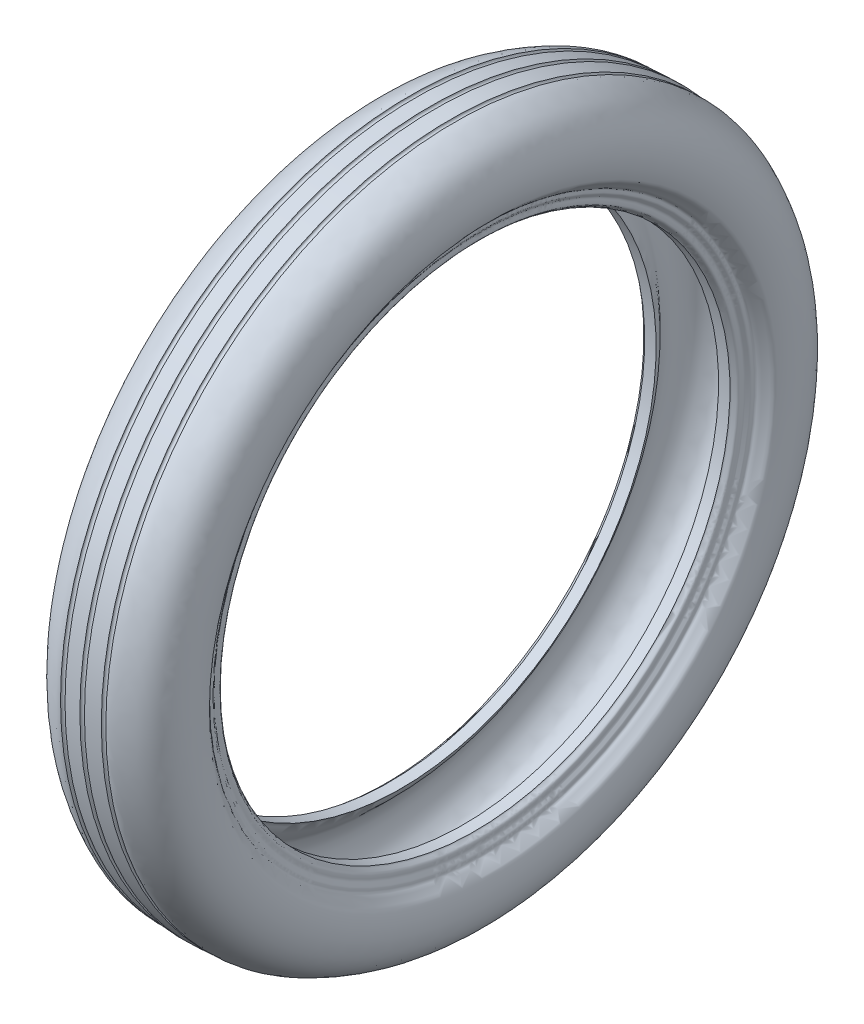
ISO-10303-21;
HEADER;
FILE_DESCRIPTION(('STEP AP214'),'2;1');
FILE_NAME('part.step','',(''),(''),'','','');
FILE_SCHEMA(('AUTOMOTIVE_DESIGN { 1 0 10303 214 1 1 1 1 }'));
ENDSEC;
DATA;
#1=APPLICATION_CONTEXT('core data for automotive mechanical design processes');
#2=APPLICATION_PROTOCOL_DEFINITION('international standard','automotive_design',2000,#1);
#3=PRODUCT_CONTEXT('',#1,'mechanical');
#4=PRODUCT('Part','Part','',(#3));
#5=PRODUCT_RELATED_PRODUCT_CATEGORY('part','',(#4));
#6=PRODUCT_DEFINITION_FORMATION('','',#4);
#7=PRODUCT_DEFINITION_CONTEXT('part definition',#1,'design');
#8=PRODUCT_DEFINITION('design','',#6,#7);
#9=PRODUCT_DEFINITION_SHAPE('','',#8);
#10=(LENGTH_UNIT() NAMED_UNIT(*) SI_UNIT(.MILLI.,.METRE.));
#11=(NAMED_UNIT(*) PLANE_ANGLE_UNIT() SI_UNIT($,.RADIAN.));
#12=(NAMED_UNIT(*) SI_UNIT($,.STERADIAN.) SOLID_ANGLE_UNIT());
#13=UNCERTAINTY_MEASURE_WITH_UNIT(LENGTH_MEASURE(1.E-05),#10,'distance_accuracy_value','');
#14=(GEOMETRIC_REPRESENTATION_CONTEXT(3) GLOBAL_UNCERTAINTY_ASSIGNED_CONTEXT((#13)) GLOBAL_UNIT_ASSIGNED_CONTEXT((#10,
#11,#12)) REPRESENTATION_CONTEXT('',''));
#15=CARTESIAN_POINT('',(0.,0.,0.));
#16=DIRECTION('',(0.,0.,1.));
#17=DIRECTION('',(1.,0.,0.));
#18=AXIS2_PLACEMENT_3D('',#15,#16,#17);
#19=CARTESIAN_POINT('',(-24.8172630139917,203.,0.));
#20=CARTESIAN_POINT('',(-27.2283998288289,205.06391431928,0.));
#21=CARTESIAN_POINT('',(-28.5496427344952,210.327625908058,0.));
#22=CARTESIAN_POINT('',(-33.6712545353592,215.019378984169,0.));
#23=CARTESIAN_POINT('',(-37.7772976660351,219.010363555149,0.));
#24=CARTESIAN_POINT('',(-42.2633577257313,223.062020269606,0.));
#25=CARTESIAN_POINT('',(-45.1671204187017,229.55393791157,0.));
#26=CARTESIAN_POINT('',(-48.0286654197166,236.65779205585,0.));
#27=CARTESIAN_POINT('',(-47.8879674715827,244.882513096217,0.));
#28=CARTESIAN_POINT('',(-46.3948773163548,254.057111445877,0.));
#29=CARTESIAN_POINT('',(-40.3486929351291,261.403587543646,0.));
#30=CARTESIAN_POINT('',(-33.851481321555,268.81086706887,0.));
#31=CARTESIAN_POINT('',(-25.2444175261157,271.404992130535,0.));
#32=CARTESIAN_POINT('',(-16.7423312191855,273.18641912113,0.));
#33=CARTESIAN_POINT('',(-10.1405547550226,273.463220362378,0.));
#34=CARTESIAN_POINT('',(-4.54429512443643,274.014061695448,0.));
#35=CARTESIAN_POINT('',(-1.75340207589833,273.445280920895,0.));
#36=CARTESIAN_POINT('',(0.,273.651830628835,0.));
#37=B_SPLINE_CURVE_WITH_KNOTS('',3,(#19,#20,#21,#22,#23,#24,#25,#26,#27,#28,#29,#30,#31,#32,#33,
#34,#35,#36),.UNSPECIFIED.,.F.,.F.,(4,1,1,1,1,1,1,1,1,1,1,1,1,1,1,4),(0.,0.0822330624444425,
0.137617146698626,0.183009302880853,0.237253629031035,0.297469874379483,0.371716047539101,
0.44060468979368,0.515818013596818,0.616103802574389,0.690267434104086,0.776013817716258,
0.849380324821276,0.924772592656254,0.952990480004338,1.),.UNSPECIFIED.);
#38=CARTESIAN_POINT('',(-102.722911074857,0.,0.));
#39=DIRECTION('',(-1.,0.,0.));
#40=AXIS1_PLACEMENT('',#38,#39);
#41=SURFACE_OF_REVOLUTION('',#37,#40);
#42=CARTESIAN_POINT('',(0.,0.,0.));
#43=DIRECTION('',(-1.,0.,0.));
#44=DIRECTION('',(0.,0.,1.));
#45=AXIS2_PLACEMENT_3D('',#42,#43,#44);
#46=CIRCLE('',#45,273.651830628835);
#47=CARTESIAN_POINT('',(0.,0.,273.651830628835));
#48=VERTEX_POINT('',#47);
#49=EDGE_CURVE('E10',#48,#48,#46,.T.);
#50=ORIENTED_EDGE('',*,*,#49,.F.);
#51=EDGE_LOOP('',(#50));
#52=FACE_BOUND('',#51,.T.);
#53=CARTESIAN_POINT('',(-24.8172630139917,0.,0.));
#54=DIRECTION('',(-1.,0.,0.));
#55=DIRECTION('',(0.,0.,1.));
#56=AXIS2_PLACEMENT_3D('',#53,#54,#55);
#57=CIRCLE('',#56,203.);
#58=CARTESIAN_POINT('',(-24.8172630139917,0.,203.));
#59=VERTEX_POINT('',#58);
#60=EDGE_CURVE('E68',#59,#59,#57,.T.);
#61=ORIENTED_EDGE('',*,*,#60,.T.);
#62=EDGE_LOOP('',(#61));
#63=FACE_BOUND('',#62,.T.);
#64=ADVANCED_FACE('F30',(#52,#63),#41,.T.);
#65=CARTESIAN_POINT('',(0.,273.651830628835,0.));
#66=CARTESIAN_POINT('',(1.7534020758983,273.445280920895,0.));
#67=CARTESIAN_POINT('',(4.5442951244364,274.014061695448,0.));
#68=CARTESIAN_POINT('',(10.1405547550225,273.463220362378,0.));
#69=CARTESIAN_POINT('',(16.7423312191854,273.186419121129,0.));
#70=CARTESIAN_POINT('',(25.2444175261157,271.404992130535,0.));
#71=CARTESIAN_POINT('',(33.851481321555,268.81086706887,0.));
#72=CARTESIAN_POINT('',(40.3486929351291,261.403587543646,0.));
#73=CARTESIAN_POINT('',(46.3948773163547,254.057111445877,0.));
#74=CARTESIAN_POINT('',(47.8879674715826,244.882513096217,0.));
#75=CARTESIAN_POINT('',(48.0286654197166,236.65779205585,0.));
#76=CARTESIAN_POINT('',(45.1671204187017,229.55393791157,0.));
#77=CARTESIAN_POINT('',(42.2633577257312,223.062020269606,0.));
#78=CARTESIAN_POINT('',(37.7772976660351,219.010363555149,0.));
#79=CARTESIAN_POINT('',(33.6712545353592,215.019378984169,0.));
#80=CARTESIAN_POINT('',(28.5496427344952,210.327625908058,0.));
#81=CARTESIAN_POINT('',(27.2283998288289,205.06391431928,0.));
#82=CARTESIAN_POINT('',(24.8172630139916,203.,0.));
#83=B_SPLINE_CURVE_WITH_KNOTS('',3,(#65,#66,#67,#68,#69,#70,#71,#72,#73,#74,#75,#76,#77,#78,#79,
#80,#81,#82),.UNSPECIFIED.,.F.,.F.,(4,1,1,1,1,1,1,1,1,1,1,1,1,1,1,4),(0.,0.0470095199956621,
0.0752274073437459,0.150619675178724,0.223986182283742,0.309732565895914,0.383896197425612,
0.484181986403182,0.55939531020632,0.628283952460899,0.702530125620518,0.762746370968965,
0.816990697119147,0.862382853301374,0.917766937555557,1.),.UNSPECIFIED.);
#84=CARTESIAN_POINT('',(-102.722911074857,0.,0.));
#85=DIRECTION('',(-1.,0.,0.));
#86=AXIS1_PLACEMENT('',#84,#85);
#87=SURFACE_OF_REVOLUTION('',#83,#86);
#88=CARTESIAN_POINT('',(24.8172630139917,0.,0.));
#89=DIRECTION('',(-1.,0.,0.));
#90=DIRECTION('',(0.,0.,1.));
#91=AXIS2_PLACEMENT_3D('',#88,#89,#90);
#92=CIRCLE('',#91,203.);
#93=CARTESIAN_POINT('',(24.8172630139917,0.,203.));
#94=VERTEX_POINT('',#93);
#95=EDGE_CURVE('E37',#94,#94,#92,.T.);
#96=ORIENTED_EDGE('',*,*,#95,.F.);
#97=EDGE_LOOP('',(#96));
#98=FACE_BOUND('',#97,.T.);
#99=ORIENTED_EDGE('',*,*,#49,.T.);
#100=EDGE_LOOP('',(#99));
#101=FACE_BOUND('',#100,.T.);
#102=ADVANCED_FACE('F115',(#98,#101),#87,.T.);
#103=CARTESIAN_POINT('',(-102.722911074857,0.,0.));
#104=DIRECTION('',(-1.,0.,0.));
#105=DIRECTION('',(0.,0.,1.));
#106=AXIS2_PLACEMENT_3D('',#103,#104,#105);
#107=CYLINDRICAL_SURFACE('',#106,203.);
#108=CARTESIAN_POINT('',(33.9052748219322,0.,0.));
#109=DIRECTION('',(-1.,0.,0.));
#110=DIRECTION('',(0.,0.,1.));
#111=AXIS2_PLACEMENT_3D('',#108,#109,#110);
#112=CIRCLE('',#111,203.);
#113=CARTESIAN_POINT('',(33.9052748219322,0.,203.));
#114=VERTEX_POINT('',#113);
#115=EDGE_CURVE('E41',#114,#114,#112,.T.);
#116=ORIENTED_EDGE('',*,*,#115,.F.);
#117=EDGE_LOOP('',(#116));
#118=FACE_BOUND('',#117,.T.);
#119=ORIENTED_EDGE('',*,*,#95,.T.);
#120=EDGE_LOOP('',(#119));
#121=FACE_BOUND('',#120,.T.);
#122=ADVANCED_FACE('F112',(#118,#121),#107,.F.);
#123=CARTESIAN_POINT('',(33.9052748219323,203.,0.));
#124=CARTESIAN_POINT('',(34.4514477122976,204.223315441255,0.));
#125=CARTESIAN_POINT('',(38.405176851135,205.210772848352,0.));
#126=CARTESIAN_POINT('',(37.5895196663085,208.702454770499,0.));
#127=CARTESIAN_POINT('',(37.3176730115443,211.637363166268,0.));
#128=CARTESIAN_POINT('',(40.3679293440638,213.465220786409,0.));
#129=CARTESIAN_POINT('',(39.0660676586276,217.086806756293,0.));
#130=CARTESIAN_POINT('',(42.5299588621192,218.987124675277,0.));
#131=CARTESIAN_POINT('',(44.4812031460707,222.024976144124,0.));
#132=CARTESIAN_POINT('',(48.1613248996428,224.664233070907,0.));
#133=CARTESIAN_POINT('',(49.3373100798012,231.297261903147,0.));
#134=CARTESIAN_POINT('',(50.5659703704679,239.217588361253,0.));
#135=CARTESIAN_POINT('',(49.5419089182548,249.309832870114,0.));
#136=CARTESIAN_POINT('',(46.4257794125868,258.785832909676,0.));
#137=CARTESIAN_POINT('',(40.6849116029119,266.454028141102,0.));
#138=CARTESIAN_POINT('',(33.8688282793654,271.544671240841,0.));
#139=CARTESIAN_POINT('',(26.5848661668035,275.239525498986,0.));
#140=CARTESIAN_POINT('',(21.3849500525043,277.770418692312,0.));
#141=CARTESIAN_POINT('',(18.0012541580362,277.496758701426,0.));
#142=B_SPLINE_CURVE_WITH_KNOTS('',3,(#123,#124,#125,#126,#127,#128,#129,#130,#131,#132,#133,
#134,#135,#136,#137,#138,#139,#140,#141),.UNSPECIFIED.,.F.,.F.,(4,1,1,1,1,1,1,1,1,1,1,1,1,1,1,1,
4),(0.,0.0502849018641816,0.0809639249454713,0.0972057606943899,0.139297033110355,
0.164562110942005,0.195188010133947,0.242420179219544,0.280702553209471,0.328072425704126,
0.440671496514186,0.53314982377352,0.638161135079807,0.746440040072595,0.823682365401741,
0.89958494243369,1.),.UNSPECIFIED.);
#143=CARTESIAN_POINT('',(-102.722911074857,0.,0.));
#144=DIRECTION('',(-1.,0.,0.));
#145=AXIS1_PLACEMENT('',#143,#144);
#146=SURFACE_OF_REVOLUTION('',#142,#145);
#147=CARTESIAN_POINT('',(18.0012541580362,0.,0.));
#148=DIRECTION('',(-1.,0.,0.));
#149=DIRECTION('',(0.,0.,1.));
#150=AXIS2_PLACEMENT_3D('',#147,#148,#149);
#151=CIRCLE('',#150,277.496758701426);
#152=CARTESIAN_POINT('',(18.0012541580362,0.,277.496758701426));
#153=VERTEX_POINT('',#152);
#154=EDGE_CURVE('E45',#153,#153,#151,.T.);
#155=ORIENTED_EDGE('',*,*,#154,.F.);
#156=EDGE_LOOP('',(#155));
#157=FACE_BOUND('',#156,.T.);
#158=ORIENTED_EDGE('',*,*,#115,.T.);
#159=EDGE_LOOP('',(#158));
#160=FACE_BOUND('',#159,.T.);
#161=ADVANCED_FACE('F108',(#157,#160),#146,.T.);
#162=CARTESIAN_POINT('',(16.2157456896604,0.,0.));
#163=DIRECTION('',(-1.,0.,0.));
#164=DIRECTION('',(0.,0.,1.));
#165=AXIS2_PLACEMENT_3D('',#162,#163,#164);
#166=TOROIDAL_SURFACE('',#165,277.496758701426,1.7855084683758);
#167=CARTESIAN_POINT('',(14.4302372212846,0.,0.));
#168=DIRECTION('',(-1.,0.,0.));
#169=DIRECTION('',(0.,0.,1.));
#170=AXIS2_PLACEMENT_3D('',#167,#168,#169);
#171=CIRCLE('',#170,277.496758701426);
#172=CARTESIAN_POINT('',(14.4302372212846,0.,277.496758701426));
#173=VERTEX_POINT('',#172);
#174=EDGE_CURVE('E50',#173,#173,#171,.T.);
#175=ORIENTED_EDGE('',*,*,#174,.F.);
#176=EDGE_LOOP('',(#175));
#177=FACE_BOUND('',#176,.T.);
#178=ORIENTED_EDGE('',*,*,#154,.T.);
#179=EDGE_LOOP('',(#178));
#180=FACE_BOUND('',#179,.T.);
#181=ADVANCED_FACE('F104',(#177,#180),#166,.F.);
#182=CARTESIAN_POINT('',(14.4302372212846,0.,0.));
#183=DIRECTION('',(-1.,0.,0.));
#184=DIRECTION('',(0.,0.,1.));
#185=AXIS2_PLACEMENT_3D('',#182,#183,#184);
#186=CONICAL_SURFACE('',#185,277.496758701426,0.0638636091062138);
#187=CARTESIAN_POINT('',(1.81905865515339,0.,0.));
#188=DIRECTION('',(-1.,0.,0.));
#189=DIRECTION('',(0.,0.,1.));
#190=AXIS2_PLACEMENT_3D('',#187,#188,#189);
#191=CIRCLE('',#190,278.303250820303);
#192=CARTESIAN_POINT('',(1.81905865515339,0.,278.303250820303));
#193=VERTEX_POINT('',#192);
#194=EDGE_CURVE('E53',#193,#193,#191,.T.);
#195=ORIENTED_EDGE('',*,*,#194,.F.);
#196=EDGE_LOOP('',(#195));
#197=FACE_BOUND('',#196,.T.);
#198=ORIENTED_EDGE('',*,*,#174,.T.);
#199=EDGE_LOOP('',(#198));
#200=FACE_BOUND('',#199,.T.);
#201=ADVANCED_FACE('F100',(#197,#200),#186,.T.);
#202=CARTESIAN_POINT('',(0.,0.,0.));
#203=DIRECTION('',(-1.,0.,0.));
#204=DIRECTION('',(0.,0.,1.));
#205=AXIS2_PLACEMENT_3D('',#202,#203,#204);
#206=TOROIDAL_SURFACE('',#205,278.303250820303,1.8190586551534);
#207=CARTESIAN_POINT('',(-1.81905865515342,0.,0.));
#208=DIRECTION('',(-1.,0.,0.));
#209=DIRECTION('',(0.,0.,1.));
#210=AXIS2_PLACEMENT_3D('',#207,#208,#209);
#211=CIRCLE('',#210,278.303250820303);
#212=CARTESIAN_POINT('',(-1.81905865515342,0.,278.303250820303));
#213=VERTEX_POINT('',#212);
#214=EDGE_CURVE('E56',#213,#213,#211,.T.);
#215=ORIENTED_EDGE('',*,*,#214,.F.);
#216=EDGE_LOOP('',(#215));
#217=FACE_BOUND('',#216,.T.);
#218=ORIENTED_EDGE('',*,*,#194,.T.);
#219=EDGE_LOOP('',(#218));
#220=FACE_BOUND('',#219,.T.);
#221=ADVANCED_FACE('F96',(#217,#220),#206,.F.);
#222=CARTESIAN_POINT('',(-1.81905865515342,0.,0.));
#223=DIRECTION('',(1.,0.,0.));
#224=DIRECTION('',(0.,0.,-1.));
#225=AXIS2_PLACEMENT_3D('',#222,#223,#224);
#226=CONICAL_SURFACE('',#225,278.303250820303,0.0638636091062136);
#227=CARTESIAN_POINT('',(-14.4302372212846,0.,0.));
#228=DIRECTION('',(-1.,0.,0.));
#229=DIRECTION('',(0.,0.,1.));
#230=AXIS2_PLACEMENT_3D('',#227,#228,#229);
#231=CIRCLE('',#230,277.496758701426);
#232=CARTESIAN_POINT('',(-14.4302372212846,0.,277.496758701426));
#233=VERTEX_POINT('',#232);
#234=EDGE_CURVE('E59',#233,#233,#231,.T.);
#235=ORIENTED_EDGE('',*,*,#234,.F.);
#236=EDGE_LOOP('',(#235));
#237=FACE_BOUND('',#236,.T.);
#238=ORIENTED_EDGE('',*,*,#214,.T.);
#239=EDGE_LOOP('',(#238));
#240=FACE_BOUND('',#239,.T.);
#241=ADVANCED_FACE('F92',(#237,#240),#226,.T.);
#242=CARTESIAN_POINT('',(-16.2157456896604,0.,0.));
#243=DIRECTION('',(-1.,0.,0.));
#244=DIRECTION('',(0.,0.,1.));
#245=AXIS2_PLACEMENT_3D('',#242,#243,#244);
#246=TOROIDAL_SURFACE('',#245,277.496758701426,1.78550846837579);
#247=CARTESIAN_POINT('',(-18.0012541580362,0.,0.));
#248=DIRECTION('',(-1.,0.,0.));
#249=DIRECTION('',(0.,0.,1.));
#250=AXIS2_PLACEMENT_3D('',#247,#248,#249);
#251=CIRCLE('',#250,277.496758701426);
#252=CARTESIAN_POINT('',(-18.0012541580362,0.,277.496758701426));
#253=VERTEX_POINT('',#252);
#254=EDGE_CURVE('E62',#253,#253,#251,.T.);
#255=ORIENTED_EDGE('',*,*,#254,.F.);
#256=EDGE_LOOP('',(#255));
#257=FACE_BOUND('',#256,.T.);
#258=ORIENTED_EDGE('',*,*,#234,.T.);
#259=EDGE_LOOP('',(#258));
#260=FACE_BOUND('',#259,.T.);
#261=ADVANCED_FACE('F88',(#257,#260),#246,.F.);
#262=CARTESIAN_POINT('',(-18.0012541580362,277.496758701426,0.));
#263=CARTESIAN_POINT('',(-21.3849500525043,277.770418692312,0.));
#264=CARTESIAN_POINT('',(-26.5848661668036,275.239525498986,0.));
#265=CARTESIAN_POINT('',(-33.8688282793654,271.544671240841,0.));
#266=CARTESIAN_POINT('',(-40.6849116029119,266.454028141102,0.));
#267=CARTESIAN_POINT('',(-46.4257794125868,258.785832909676,0.));
#268=CARTESIAN_POINT('',(-49.5419089182548,249.309832870114,0.));
#269=CARTESIAN_POINT('',(-50.5659703704679,239.217588361253,0.));
#270=CARTESIAN_POINT('',(-49.3373100798012,231.297261903147,0.));
#271=CARTESIAN_POINT('',(-48.1613248996428,224.664233070907,0.));
#272=CARTESIAN_POINT('',(-44.4812031460707,222.024976144124,0.));
#273=CARTESIAN_POINT('',(-42.5299588621193,218.987124675277,0.));
#274=CARTESIAN_POINT('',(-39.0660676586276,217.086806756293,0.));
#275=CARTESIAN_POINT('',(-40.3679293440638,213.465220786409,0.));
#276=CARTESIAN_POINT('',(-37.3176730115443,211.637363166268,0.));
#277=CARTESIAN_POINT('',(-37.5895196663085,208.702454770499,0.));
#278=CARTESIAN_POINT('',(-38.405176851135,205.210772848352,0.));
#279=CARTESIAN_POINT('',(-34.4514477122976,204.223315441255,0.));
#280=CARTESIAN_POINT('',(-33.9052748219323,203.,0.));
#281=B_SPLINE_CURVE_WITH_KNOTS('',3,(#262,#263,#264,#265,#266,#267,#268,#269,#270,#271,#272,
#273,#274,#275,#276,#277,#278,#279,#280),.UNSPECIFIED.,.F.,.F.,(4,1,1,1,1,1,1,1,1,1,1,1,1,1,1,1,
4),(0.,0.10041505756631,0.176317634598259,0.253559959927405,0.361838864920193,0.46685017622648,
0.559328503485814,0.671927574295874,0.719297446790528,0.757579820780456,0.804811989866053,
0.835437889057995,0.860702966889645,0.90279423930561,0.919036075054529,0.949715098135818,1.),.UNSPECIFIED.);
#282=CARTESIAN_POINT('',(-102.722911074857,0.,0.));
#283=DIRECTION('',(-1.,0.,0.));
#284=AXIS1_PLACEMENT('',#282,#283);
#285=SURFACE_OF_REVOLUTION('',#281,#284);
#286=CARTESIAN_POINT('',(-33.9052748219323,0.,0.));
#287=DIRECTION('',(-1.,0.,0.));
#288=DIRECTION('',(0.,0.,1.));
#289=AXIS2_PLACEMENT_3D('',#286,#287,#288);
#290=CIRCLE('',#289,203.);
#291=CARTESIAN_POINT('',(-33.9052748219323,0.,203.));
#292=VERTEX_POINT('',#291);
#293=EDGE_CURVE('E65',#292,#292,#290,.T.);
#294=ORIENTED_EDGE('',*,*,#293,.F.);
#295=EDGE_LOOP('',(#294));
#296=FACE_BOUND('',#295,.T.);
#297=ORIENTED_EDGE('',*,*,#254,.T.);
#298=EDGE_LOOP('',(#297));
#299=FACE_BOUND('',#298,.T.);
#300=ADVANCED_FACE('F83',(#296,#299),#285,.T.);
#301=CARTESIAN_POINT('',(-102.722911074857,0.,0.));
#302=DIRECTION('',(-1.,0.,0.));
#303=DIRECTION('',(0.,0.,1.));
#304=AXIS2_PLACEMENT_3D('',#301,#302,#303);
#305=CYLINDRICAL_SURFACE('',#304,203.);
#306=ORIENTED_EDGE('',*,*,#60,.F.);
#307=EDGE_LOOP('',(#306));
#308=FACE_BOUND('',#307,.T.);
#309=ORIENTED_EDGE('',*,*,#293,.T.);
#310=EDGE_LOOP('',(#309));
#311=FACE_BOUND('',#310,.T.);
#312=ADVANCED_FACE('F87',(#308,#311),#305,.F.);
#313=CLOSED_SHELL('',(#64,#102,#122,#161,#181,#201,#221,#241,#261,#300,#312));
#314=MANIFOLD_SOLID_BREP('B2',#313);
#315=ADVANCED_BREP_SHAPE_REPRESENTATION('',(#18,#314),#14);
#316=SHAPE_DEFINITION_REPRESENTATION(#9,#315);
ENDSEC;
END-ISO-10303-21;
